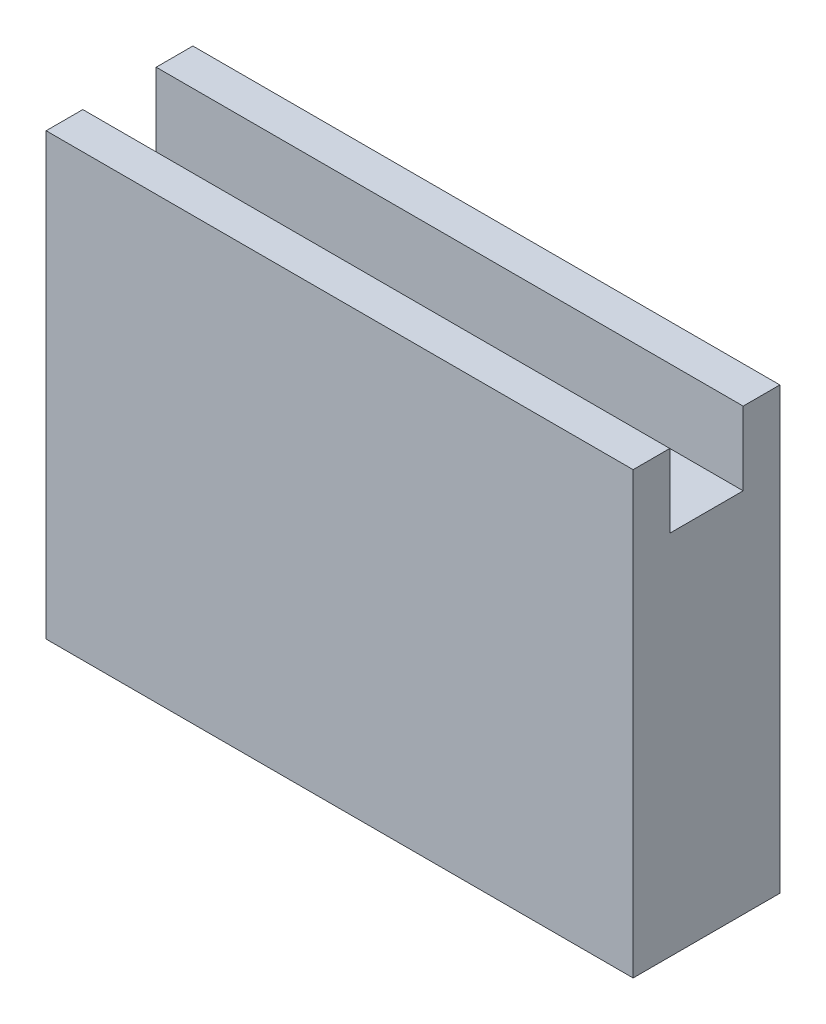
ISO-10303-21;
HEADER;
FILE_DESCRIPTION(('STEP AP214'),'2;1');
FILE_NAME('part.step','',(''),(''),'','','');
FILE_SCHEMA(('AUTOMOTIVE_DESIGN { 1 0 10303 214 1 1 1 1 }'));
ENDSEC;
DATA;
#1=APPLICATION_CONTEXT('core data for automotive mechanical design processes');
#2=APPLICATION_PROTOCOL_DEFINITION('international standard','automotive_design',2000,#1);
#3=PRODUCT_CONTEXT('',#1,'mechanical');
#4=PRODUCT('Part','Part','',(#3));
#5=PRODUCT_RELATED_PRODUCT_CATEGORY('part','',(#4));
#6=PRODUCT_DEFINITION_FORMATION('','',#4);
#7=PRODUCT_DEFINITION_CONTEXT('part definition',#1,'design');
#8=PRODUCT_DEFINITION('design','',#6,#7);
#9=PRODUCT_DEFINITION_SHAPE('','',#8);
#10=(LENGTH_UNIT() NAMED_UNIT(*) SI_UNIT(.MILLI.,.METRE.));
#11=(NAMED_UNIT(*) PLANE_ANGLE_UNIT() SI_UNIT($,.RADIAN.));
#12=(NAMED_UNIT(*) SI_UNIT($,.STERADIAN.) SOLID_ANGLE_UNIT());
#13=UNCERTAINTY_MEASURE_WITH_UNIT(LENGTH_MEASURE(1.E-05),#10,'distance_accuracy_value','');
#14=(GEOMETRIC_REPRESENTATION_CONTEXT(3) GLOBAL_UNCERTAINTY_ASSIGNED_CONTEXT((#13)) GLOBAL_UNIT_ASSIGNED_CONTEXT((#10,
#11,#12)) REPRESENTATION_CONTEXT('',''));
#15=CARTESIAN_POINT('',(0.,0.,0.));
#16=DIRECTION('',(0.,0.,1.));
#17=DIRECTION('',(1.,0.,0.));
#18=AXIS2_PLACEMENT_3D('',#15,#16,#17);
#19=CARTESIAN_POINT('',(0.,31.75,0.));
#20=DIRECTION('',(0.,1.,0.));
#21=DIRECTION('',(0.,0.,1.));
#22=AXIS2_PLACEMENT_3D('',#19,#20,#21);
#23=PLANE('',#22);
#24=DIRECTION('',(0.,0.,-1.));
#25=VECTOR('',#24,1.);
#26=CARTESIAN_POINT('',(25.4,31.75,6.35));
#27=LINE('',#26,#25);
#28=CARTESIAN_POINT('',(25.4,31.75,3.175));
#29=VERTEX_POINT('',#28);
#30=CARTESIAN_POINT('',(25.4,31.75,-3.175));
#31=VERTEX_POINT('',#30);
#32=EDGE_CURVE('E147',#29,#31,#27,.T.);
#33=ORIENTED_EDGE('',*,*,#32,.T.);
#34=DIRECTION('',(1.,0.,0.));
#35=VECTOR('',#34,1.);
#36=CARTESIAN_POINT('',(25.4,31.75,-3.175));
#37=LINE('',#36,#35);
#38=CARTESIAN_POINT('',(-25.4,31.75,-3.175));
#39=VERTEX_POINT('',#38);
#40=EDGE_CURVE('E120',#39,#31,#37,.T.);
#41=ORIENTED_EDGE('',*,*,#40,.F.);
#42=DIRECTION('',(0.,0.,-1.));
#43=VECTOR('',#42,1.);
#44=CARTESIAN_POINT('',(-25.4,31.75,6.35));
#45=LINE('',#44,#43);
#46=CARTESIAN_POINT('',(-25.4,31.75,3.175));
#47=VERTEX_POINT('',#46);
#48=EDGE_CURVE('E149',#47,#39,#45,.T.);
#49=ORIENTED_EDGE('',*,*,#48,.F.);
#50=DIRECTION('',(-1.,0.,0.));
#51=VECTOR('',#50,1.);
#52=CARTESIAN_POINT('',(-25.4,31.75,3.175));
#53=LINE('',#52,#51);
#54=EDGE_CURVE('E56',#29,#47,#53,.T.);
#55=ORIENTED_EDGE('',*,*,#54,.F.);
#56=EDGE_LOOP('',(#33,#41,#49,#55));
#57=FACE_BOUND('',#56,.T.);
#58=ADVANCED_FACE('F33',(#57),#23,.T.);
#59=CARTESIAN_POINT('',(-25.4,31.75,6.35));
#60=DIRECTION('',(0.,0.,-1.));
#61=DIRECTION('',(-1.,0.,0.));
#62=AXIS2_PLACEMENT_3D('',#59,#60,#61);
#63=PLANE('',#62);
#64=DIRECTION('',(1.,0.,0.));
#65=VECTOR('',#64,1.);
#66=CARTESIAN_POINT('',(-25.4,0.,6.35));
#67=LINE('',#66,#65);
#68=CARTESIAN_POINT('',(-25.4,0.,6.35));
#69=VERTEX_POINT('',#68);
#70=CARTESIAN_POINT('',(25.4,0.,6.35));
#71=VERTEX_POINT('',#70);
#72=EDGE_CURVE('E146',#69,#71,#67,.T.);
#73=ORIENTED_EDGE('',*,*,#72,.T.);
#74=DIRECTION('',(0.,-1.,0.));
#75=VECTOR('',#74,1.);
#76=CARTESIAN_POINT('',(25.4,31.75,6.35));
#77=LINE('',#76,#75);
#78=CARTESIAN_POINT('',(25.4,38.1,6.35));
#79=VERTEX_POINT('',#78);
#80=EDGE_CURVE('E11',#79,#71,#77,.T.);
#81=ORIENTED_EDGE('',*,*,#80,.F.);
#82=DIRECTION('',(1.,0.,0.));
#83=VECTOR('',#82,1.);
#84=CARTESIAN_POINT('',(-25.4,38.1,6.35));
#85=LINE('',#84,#83);
#86=CARTESIAN_POINT('',(-25.4,38.1,6.35));
#87=VERTEX_POINT('',#86);
#88=EDGE_CURVE('E132',#87,#79,#85,.T.);
#89=ORIENTED_EDGE('',*,*,#88,.F.);
#90=DIRECTION('',(0.,-1.,0.));
#91=VECTOR('',#90,1.);
#92=CARTESIAN_POINT('',(-25.4,31.75,6.35));
#93=LINE('',#92,#91);
#94=EDGE_CURVE('E153',#87,#69,#93,.T.);
#95=ORIENTED_EDGE('',*,*,#94,.T.);
#96=EDGE_LOOP('',(#73,#81,#89,#95));
#97=FACE_BOUND('',#96,.T.);
#98=ADVANCED_FACE('F35',(#97),#63,.F.);
#99=CARTESIAN_POINT('',(25.4,31.75,6.35));
#100=DIRECTION('',(-1.,0.,0.));
#101=DIRECTION('',(0.,0.,1.));
#102=AXIS2_PLACEMENT_3D('',#99,#100,#101);
#103=PLANE('',#102);
#104=DIRECTION('',(0.,0.,-1.));
#105=VECTOR('',#104,1.);
#106=CARTESIAN_POINT('',(25.4,0.,6.35));
#107=LINE('',#106,#105);
#108=CARTESIAN_POINT('',(25.4,0.,-6.35));
#109=VERTEX_POINT('',#108);
#110=EDGE_CURVE('E105',#71,#109,#107,.T.);
#111=ORIENTED_EDGE('',*,*,#110,.T.);
#112=DIRECTION('',(0.,-1.,0.));
#113=VECTOR('',#112,1.);
#114=CARTESIAN_POINT('',(25.4,31.75,-6.35));
#115=LINE('',#114,#113);
#116=CARTESIAN_POINT('',(25.4,38.1,-6.35));
#117=VERTEX_POINT('',#116);
#118=EDGE_CURVE('E41',#117,#109,#115,.T.);
#119=ORIENTED_EDGE('',*,*,#118,.F.);
#120=DIRECTION('',(0.,0.,-1.));
#121=VECTOR('',#120,1.);
#122=CARTESIAN_POINT('',(25.4,38.1,-6.35));
#123=LINE('',#122,#121);
#124=CARTESIAN_POINT('',(25.4,38.1,-3.175));
#125=VERTEX_POINT('',#124);
#126=EDGE_CURVE('E104',#125,#117,#123,.T.);
#127=ORIENTED_EDGE('',*,*,#126,.F.);
#128=DIRECTION('',(0.,-1.,0.));
#129=VECTOR('',#128,1.);
#130=CARTESIAN_POINT('',(25.4,38.1,-3.175));
#131=LINE('',#130,#129);
#132=EDGE_CURVE('E125',#125,#31,#131,.T.);
#133=ORIENTED_EDGE('',*,*,#132,.T.);
#134=ORIENTED_EDGE('',*,*,#32,.F.);
#135=DIRECTION('',(0.,-1.,0.));
#136=VECTOR('',#135,1.);
#137=CARTESIAN_POINT('',(25.4,38.1,3.175));
#138=LINE('',#137,#136);
#139=CARTESIAN_POINT('',(25.4,38.1,3.175));
#140=VERTEX_POINT('',#139);
#141=EDGE_CURVE('E143',#140,#29,#138,.T.);
#142=ORIENTED_EDGE('',*,*,#141,.F.);
#143=DIRECTION('',(0.,0.,-1.));
#144=VECTOR('',#143,1.);
#145=CARTESIAN_POINT('',(25.4,38.1,6.35));
#146=LINE('',#145,#144);
#147=EDGE_CURVE('E135',#79,#140,#146,.T.);
#148=ORIENTED_EDGE('',*,*,#147,.F.);
#149=ORIENTED_EDGE('',*,*,#80,.T.);
#150=EDGE_LOOP('',(#111,#119,#127,#133,#134,#142,#148,#149));
#151=FACE_BOUND('',#150,.T.);
#152=ADVANCED_FACE('F101',(#151),#103,.F.);
#153=CARTESIAN_POINT('',(-25.4,31.75,-6.35));
#154=DIRECTION('',(0.,0.,-1.));
#155=DIRECTION('',(-1.,0.,0.));
#156=AXIS2_PLACEMENT_3D('',#153,#154,#155);
#157=PLANE('',#156);
#158=DIRECTION('',(1.,0.,0.));
#159=VECTOR('',#158,1.);
#160=CARTESIAN_POINT('',(-25.4,0.,-6.35));
#161=LINE('',#160,#159);
#162=CARTESIAN_POINT('',(-25.4,0.,-6.35));
#163=VERTEX_POINT('',#162);
#164=EDGE_CURVE('E157',#163,#109,#161,.T.);
#165=ORIENTED_EDGE('',*,*,#164,.F.);
#166=DIRECTION('',(0.,-1.,0.));
#167=VECTOR('',#166,1.);
#168=CARTESIAN_POINT('',(-25.4,31.75,-6.35));
#169=LINE('',#168,#167);
#170=CARTESIAN_POINT('',(-25.4,38.1,-6.35));
#171=VERTEX_POINT('',#170);
#172=EDGE_CURVE('E109',#171,#163,#169,.T.);
#173=ORIENTED_EDGE('',*,*,#172,.F.);
#174=DIRECTION('',(-1.,0.,0.));
#175=VECTOR('',#174,1.);
#176=CARTESIAN_POINT('',(25.4,38.1,-6.35));
#177=LINE('',#176,#175);
#178=EDGE_CURVE('E111',#117,#171,#177,.T.);
#179=ORIENTED_EDGE('',*,*,#178,.F.);
#180=ORIENTED_EDGE('',*,*,#118,.T.);
#181=EDGE_LOOP('',(#165,#173,#179,#180));
#182=FACE_BOUND('',#181,.T.);
#183=ADVANCED_FACE('F112',(#182),#157,.T.);
#184=CARTESIAN_POINT('',(-25.4,31.75,6.35));
#185=DIRECTION('',(-1.,0.,0.));
#186=DIRECTION('',(0.,0.,1.));
#187=AXIS2_PLACEMENT_3D('',#184,#185,#186);
#188=PLANE('',#187);
#189=DIRECTION('',(0.,0.,-1.));
#190=VECTOR('',#189,1.);
#191=CARTESIAN_POINT('',(-25.4,0.,6.35));
#192=LINE('',#191,#190);
#193=EDGE_CURVE('E150',#69,#163,#192,.T.);
#194=ORIENTED_EDGE('',*,*,#193,.F.);
#195=ORIENTED_EDGE('',*,*,#94,.F.);
#196=DIRECTION('',(0.,0.,1.));
#197=VECTOR('',#196,1.);
#198=CARTESIAN_POINT('',(-25.4,38.1,6.35));
#199=LINE('',#198,#197);
#200=CARTESIAN_POINT('',(-25.4,38.1,3.175));
#201=VERTEX_POINT('',#200);
#202=EDGE_CURVE('E129',#201,#87,#199,.T.);
#203=ORIENTED_EDGE('',*,*,#202,.F.);
#204=DIRECTION('',(0.,-1.,0.));
#205=VECTOR('',#204,1.);
#206=CARTESIAN_POINT('',(-25.4,38.1,3.175));
#207=LINE('',#206,#205);
#208=EDGE_CURVE('E139',#201,#47,#207,.T.);
#209=ORIENTED_EDGE('',*,*,#208,.T.);
#210=ORIENTED_EDGE('',*,*,#48,.T.);
#211=DIRECTION('',(0.,-1.,0.));
#212=VECTOR('',#211,1.);
#213=CARTESIAN_POINT('',(-25.4,38.1,-3.17499999999999));
#214=LINE('',#213,#212);
#215=CARTESIAN_POINT('',(-25.4,38.1,-3.17499999999999));
#216=VERTEX_POINT('',#215);
#217=EDGE_CURVE('E48',#216,#39,#214,.T.);
#218=ORIENTED_EDGE('',*,*,#217,.F.);
#219=DIRECTION('',(0.,0.,1.));
#220=VECTOR('',#219,1.);
#221=CARTESIAN_POINT('',(-25.4,38.1,-6.35));
#222=LINE('',#221,#220);
#223=EDGE_CURVE('E115',#171,#216,#222,.T.);
#224=ORIENTED_EDGE('',*,*,#223,.F.);
#225=ORIENTED_EDGE('',*,*,#172,.T.);
#226=EDGE_LOOP('',(#194,#195,#203,#209,#210,#218,#224,#225));
#227=FACE_BOUND('',#226,.T.);
#228=ADVANCED_FACE('F164',(#227),#188,.T.);
#229=CARTESIAN_POINT('',(0.,0.,0.));
#230=DIRECTION('',(0.,1.,0.));
#231=DIRECTION('',(0.,0.,1.));
#232=AXIS2_PLACEMENT_3D('',#229,#230,#231);
#233=PLANE('',#232);
#234=ORIENTED_EDGE('',*,*,#72,.F.);
#235=ORIENTED_EDGE('',*,*,#193,.T.);
#236=ORIENTED_EDGE('',*,*,#164,.T.);
#237=ORIENTED_EDGE('',*,*,#110,.F.);
#238=EDGE_LOOP('',(#234,#235,#236,#237));
#239=FACE_BOUND('',#238,.T.);
#240=ADVANCED_FACE('F167',(#239),#233,.F.);
#241=CARTESIAN_POINT('',(-25.4,38.1,3.175));
#242=DIRECTION('',(0.,0.,1.));
#243=DIRECTION('',(1.,0.,0.));
#244=AXIS2_PLACEMENT_3D('',#241,#242,#243);
#245=PLANE('',#244);
#246=ORIENTED_EDGE('',*,*,#54,.T.);
#247=ORIENTED_EDGE('',*,*,#208,.F.);
#248=DIRECTION('',(-1.,0.,0.));
#249=VECTOR('',#248,1.);
#250=CARTESIAN_POINT('',(-25.4,38.1,3.175));
#251=LINE('',#250,#249);
#252=EDGE_CURVE('E137',#140,#201,#251,.T.);
#253=ORIENTED_EDGE('',*,*,#252,.F.);
#254=ORIENTED_EDGE('',*,*,#141,.T.);
#255=EDGE_LOOP('',(#246,#247,#253,#254));
#256=FACE_BOUND('',#255,.T.);
#257=ADVANCED_FACE('F178',(#256),#245,.F.);
#258=CARTESIAN_POINT('',(0.,38.1,0.));
#259=DIRECTION('',(0.,-1.,0.));
#260=DIRECTION('',(0.,0.,-1.));
#261=AXIS2_PLACEMENT_3D('',#258,#259,#260);
#262=PLANE('',#261);
#263=ORIENTED_EDGE('',*,*,#202,.T.);
#264=ORIENTED_EDGE('',*,*,#88,.T.);
#265=ORIENTED_EDGE('',*,*,#147,.T.);
#266=ORIENTED_EDGE('',*,*,#252,.T.);
#267=EDGE_LOOP('',(#263,#264,#265,#266));
#268=FACE_BOUND('',#267,.T.);
#269=ADVANCED_FACE('F173',(#268),#262,.F.);
#270=CARTESIAN_POINT('',(25.4,38.1,-3.175));
#271=DIRECTION('',(0.,0.,-1.));
#272=DIRECTION('',(-1.,0.,0.));
#273=AXIS2_PLACEMENT_3D('',#270,#271,#272);
#274=PLANE('',#273);
#275=ORIENTED_EDGE('',*,*,#40,.T.);
#276=ORIENTED_EDGE('',*,*,#132,.F.);
#277=DIRECTION('',(1.,0.,0.));
#278=VECTOR('',#277,1.);
#279=CARTESIAN_POINT('',(25.4,38.1,-3.175));
#280=LINE('',#279,#278);
#281=EDGE_CURVE('E118',#216,#125,#280,.T.);
#282=ORIENTED_EDGE('',*,*,#281,.F.);
#283=ORIENTED_EDGE('',*,*,#217,.T.);
#284=EDGE_LOOP('',(#275,#276,#282,#283));
#285=FACE_BOUND('',#284,.T.);
#286=ADVANCED_FACE('F179',(#285),#274,.F.);
#287=CARTESIAN_POINT('',(0.,38.1,0.));
#288=DIRECTION('',(0.,-1.,0.));
#289=DIRECTION('',(0.,0.,-1.));
#290=AXIS2_PLACEMENT_3D('',#287,#288,#289);
#291=PLANE('',#290);
#292=ORIENTED_EDGE('',*,*,#126,.T.);
#293=ORIENTED_EDGE('',*,*,#178,.T.);
#294=ORIENTED_EDGE('',*,*,#223,.T.);
#295=ORIENTED_EDGE('',*,*,#281,.T.);
#296=EDGE_LOOP('',(#292,#293,#294,#295));
#297=FACE_BOUND('',#296,.T.);
#298=ADVANCED_FACE('F117',(#297),#291,.F.);
#299=CLOSED_SHELL('',(#58,#98,#152,#183,#228,#240,#257,#269,#286,#298));
#300=MANIFOLD_SOLID_BREP('B2',#299);
#301=ADVANCED_BREP_SHAPE_REPRESENTATION('',(#18,#300),#14);
#302=SHAPE_DEFINITION_REPRESENTATION(#9,#301);
ENDSEC;
END-ISO-10303-21;
